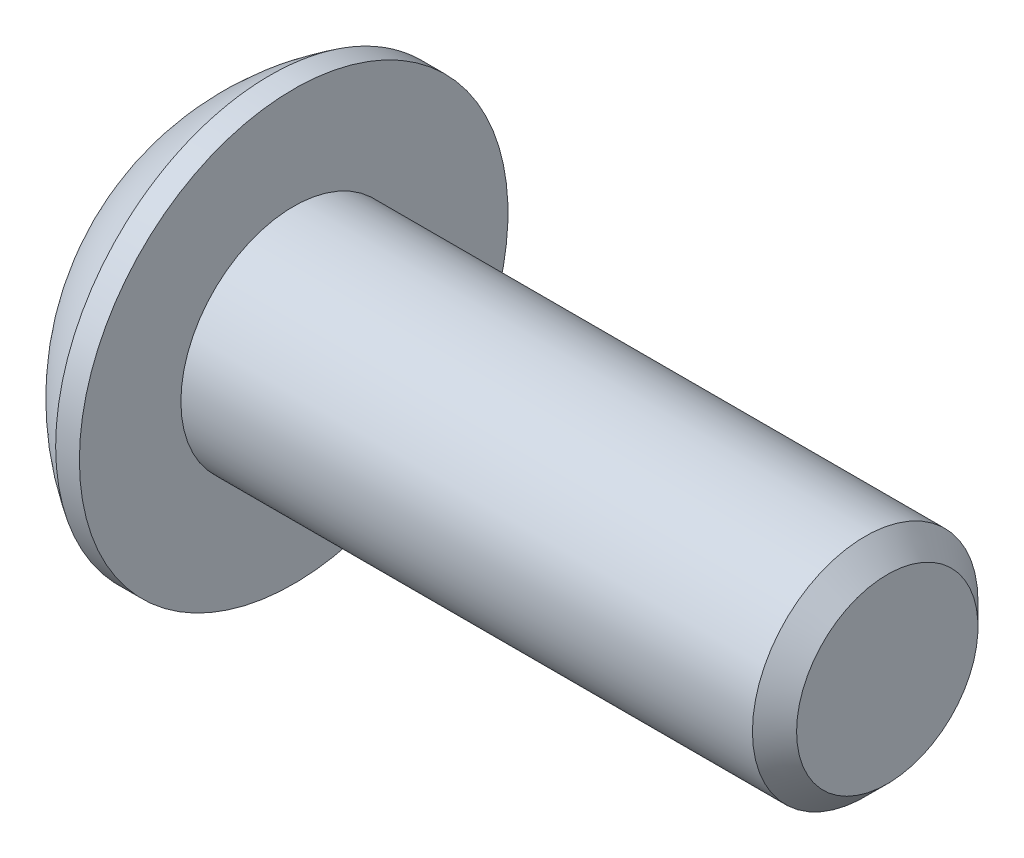
ISO-10303-21;
HEADER;
FILE_DESCRIPTION(('STEP AP214'),'2;1');
FILE_NAME('part.step','',(''),(''),'','','');
FILE_SCHEMA(('AUTOMOTIVE_DESIGN { 1 0 10303 214 1 1 1 1 }'));
ENDSEC;
DATA;
#1=APPLICATION_CONTEXT('core data for automotive mechanical design processes');
#2=APPLICATION_PROTOCOL_DEFINITION('international standard','automotive_design',2000,#1);
#3=PRODUCT_CONTEXT('',#1,'mechanical');
#4=PRODUCT('Part','Part','',(#3));
#5=PRODUCT_RELATED_PRODUCT_CATEGORY('part','',(#4));
#6=PRODUCT_DEFINITION_FORMATION('','',#4);
#7=PRODUCT_DEFINITION_CONTEXT('part definition',#1,'design');
#8=PRODUCT_DEFINITION('design','',#6,#7);
#9=PRODUCT_DEFINITION_SHAPE('','',#8);
#10=(LENGTH_UNIT() NAMED_UNIT(*) SI_UNIT(.MILLI.,.METRE.));
#11=(NAMED_UNIT(*) PLANE_ANGLE_UNIT() SI_UNIT($,.RADIAN.));
#12=(NAMED_UNIT(*) SI_UNIT($,.STERADIAN.) SOLID_ANGLE_UNIT());
#13=UNCERTAINTY_MEASURE_WITH_UNIT(LENGTH_MEASURE(1.E-05),#10,'distance_accuracy_value','');
#14=(GEOMETRIC_REPRESENTATION_CONTEXT(3) GLOBAL_UNCERTAINTY_ASSIGNED_CONTEXT((#13)) GLOBAL_UNIT_ASSIGNED_CONTEXT((#10,
#11,#12)) REPRESENTATION_CONTEXT('',''));
#15=CARTESIAN_POINT('',(0.,0.,0.));
#16=DIRECTION('',(0.,0.,1.));
#17=DIRECTION('',(1.,0.,0.));
#18=AXIS2_PLACEMENT_3D('',#15,#16,#17);
#19=CARTESIAN_POINT('',(1.77800000000017,0.,0.));
#20=DIRECTION('',(-1.,0.,0.));
#21=DIRECTION('',(0.,0.,1.));
#22=AXIS2_PLACEMENT_3D('',#19,#20,#21);
#23=CONICAL_SURFACE('',#22,1.58749999999985,1.04719755119662);
#24=CARTESIAN_POINT('',(2.69454355233856,0.,0.));
#25=VERTEX_POINT('',#24);
#26=VERTEX_LOOP('',#25);
#27=FACE_BOUND('',#26,.T.);
#28=CARTESIAN_POINT('',(1.77800000000017,0.,0.));
#29=DIRECTION('',(-1.,0.,0.));
#30=DIRECTION('',(0.,0.,1.));
#31=AXIS2_PLACEMENT_3D('',#28,#29,#30);
#32=CIRCLE('',#31,1.58749999999985);
#33=CARTESIAN_POINT('',(1.77800000000008,0.,1.58749999999993));
#34=VERTEX_POINT('',#33);
#35=CARTESIAN_POINT('',(1.77800000000008,-1.37481532850773,0.793749999999963));
#36=VERTEX_POINT('',#35);
#37=EDGE_CURVE('E20',#34,#36,#32,.F.);
#38=ORIENTED_EDGE('',*,*,#37,.F.);
#39=CARTESIAN_POINT('',(1.77800000000017,0.,0.));
#40=DIRECTION('',(-1.,0.,0.));
#41=DIRECTION('',(0.,0.,1.));
#42=AXIS2_PLACEMENT_3D('',#39,#40,#41);
#43=CIRCLE('',#42,1.58749999999985);
#44=CARTESIAN_POINT('',(1.77800000000008,1.37481532850773,0.793749999999963));
#45=VERTEX_POINT('',#44);
#46=EDGE_CURVE('E90',#34,#45,#43,.T.);
#47=ORIENTED_EDGE('',*,*,#46,.T.);
#48=CARTESIAN_POINT('',(1.77800000000017,0.,0.));
#49=DIRECTION('',(-1.,0.,0.));
#50=DIRECTION('',(0.,0.,1.));
#51=AXIS2_PLACEMENT_3D('',#48,#49,#50);
#52=CIRCLE('',#51,1.58749999999985);
#53=CARTESIAN_POINT('',(1.77800000000008,1.37481532850773,-0.793749999999964));
#54=VERTEX_POINT('',#53);
#55=EDGE_CURVE('E106',#45,#54,#52,.T.);
#56=ORIENTED_EDGE('',*,*,#55,.T.);
#57=CARTESIAN_POINT('',(1.77800000000017,0.,0.));
#58=DIRECTION('',(-1.,0.,0.));
#59=DIRECTION('',(0.,0.,1.));
#60=AXIS2_PLACEMENT_3D('',#57,#58,#59);
#61=CIRCLE('',#60,1.58749999999985);
#62=CARTESIAN_POINT('',(1.77800000000008,2.13833679173112E-12,-1.58749999999993));
#63=VERTEX_POINT('',#62);
#64=EDGE_CURVE('E444',#54,#63,#61,.T.);
#65=ORIENTED_EDGE('',*,*,#64,.T.);
#66=CARTESIAN_POINT('',(1.77800000000017,0.,0.));
#67=DIRECTION('',(-1.,0.,0.));
#68=DIRECTION('',(0.,0.,1.));
#69=AXIS2_PLACEMENT_3D('',#66,#67,#68);
#70=CIRCLE('',#69,1.58749999999985);
#71=CARTESIAN_POINT('',(1.77800000000008,-1.37481532850773,-0.793749999999963));
#72=VERTEX_POINT('',#71);
#73=EDGE_CURVE('E446',#72,#63,#70,.F.);
#74=ORIENTED_EDGE('',*,*,#73,.F.);
#75=CARTESIAN_POINT('',(1.77800000000017,0.,0.));
#76=DIRECTION('',(-1.,0.,0.));
#77=DIRECTION('',(0.,0.,1.));
#78=AXIS2_PLACEMENT_3D('',#75,#76,#77);
#79=CIRCLE('',#78,1.58749999999985);
#80=EDGE_CURVE('E93',#36,#72,#79,.F.);
#81=ORIENTED_EDGE('',*,*,#80,.F.);
#82=EDGE_LOOP('',(#38,#47,#56,#65,#74,#81));
#83=FACE_BOUND('',#82,.T.);
#84=ADVANCED_FACE('F17',(#27,#83),#23,.F.);
#85=CARTESIAN_POINT('',(1.778,-2.74963065701559,-1.5875));
#86=DIRECTION('',(1.,0.,0.));
#87=DIRECTION('',(0.,0.,-1.));
#88=AXIS2_PLACEMENT_3D('',#85,#86,#87);
#89=PLANE('',#88);
#90=DIRECTION('',(0.,0.5,0.866025403784439));
#91=VECTOR('',#90,1.);
#92=CARTESIAN_POINT('',(1.778,-1.83308710467706,0.));
#93=LINE('',#92,#91);
#94=CARTESIAN_POINT('',(1.778,-0.916543552338531,1.5875));
#95=VERTEX_POINT('',#94);
#96=EDGE_CURVE('E111',#95,#36,#93,.F.);
#97=ORIENTED_EDGE('',*,*,#96,.F.);
#98=DIRECTION('',(0.,1.,0.));
#99=VECTOR('',#98,1.);
#100=CARTESIAN_POINT('',(1.778,-0.916543552338531,1.5875));
#101=LINE('',#100,#99);
#102=EDGE_CURVE('E109',#34,#95,#101,.F.);
#103=ORIENTED_EDGE('',*,*,#102,.F.);
#104=ORIENTED_EDGE('',*,*,#37,.T.);
#105=EDGE_LOOP('',(#97,#103,#104));
#106=FACE_BOUND('',#105,.T.);
#107=ADVANCED_FACE('F110',(#106),#89,.F.);
#108=CARTESIAN_POINT('',(1.778,-2.74963065701559,-1.5875));
#109=DIRECTION('',(1.,0.,0.));
#110=DIRECTION('',(0.,0.,-1.));
#111=AXIS2_PLACEMENT_3D('',#108,#109,#110);
#112=PLANE('',#111);
#113=DIRECTION('',(0.,-0.5,0.866025403784439));
#114=VECTOR('',#113,1.);
#115=CARTESIAN_POINT('',(1.778,-0.916543552338531,-1.5875));
#116=LINE('',#115,#114);
#117=CARTESIAN_POINT('',(1.778,-1.83308710467706,0.));
#118=VERTEX_POINT('',#117);
#119=EDGE_CURVE('E159',#118,#72,#116,.F.);
#120=ORIENTED_EDGE('',*,*,#119,.F.);
#121=DIRECTION('',(0.,0.5,0.866025403784439));
#122=VECTOR('',#121,1.);
#123=CARTESIAN_POINT('',(1.778,-1.83308710467706,0.));
#124=LINE('',#123,#122);
#125=EDGE_CURVE('E171',#36,#118,#124,.F.);
#126=ORIENTED_EDGE('',*,*,#125,.F.);
#127=ORIENTED_EDGE('',*,*,#80,.T.);
#128=EDGE_LOOP('',(#120,#126,#127));
#129=FACE_BOUND('',#128,.T.);
#130=ADVANCED_FACE('F248',(#129),#112,.F.);
#131=CARTESIAN_POINT('',(1.778,-2.74963065701559,-1.5875));
#132=DIRECTION('',(1.,0.,0.));
#133=DIRECTION('',(0.,0.,-1.));
#134=AXIS2_PLACEMENT_3D('',#131,#132,#133);
#135=PLANE('',#134);
#136=DIRECTION('',(0.,1.,0.));
#137=VECTOR('',#136,1.);
#138=CARTESIAN_POINT('',(1.778,0.916543552338531,-1.5875));
#139=LINE('',#138,#137);
#140=CARTESIAN_POINT('',(1.778,-0.916543552338531,-1.5875));
#141=VERTEX_POINT('',#140);
#142=EDGE_CURVE('E143',#141,#63,#139,.T.);
#143=ORIENTED_EDGE('',*,*,#142,.F.);
#144=DIRECTION('',(0.,-0.5,0.866025403784439));
#145=VECTOR('',#144,1.);
#146=CARTESIAN_POINT('',(1.778,-0.916543552338531,-1.5875));
#147=LINE('',#146,#145);
#148=EDGE_CURVE('E156',#72,#141,#147,.F.);
#149=ORIENTED_EDGE('',*,*,#148,.F.);
#150=ORIENTED_EDGE('',*,*,#73,.T.);
#151=EDGE_LOOP('',(#143,#149,#150));
#152=FACE_BOUND('',#151,.T.);
#153=ADVANCED_FACE('F244',(#152),#135,.F.);
#154=CARTESIAN_POINT('',(1.778,-2.74963065701559,-1.5875));
#155=DIRECTION('',(1.,0.,0.));
#156=DIRECTION('',(0.,0.,-1.));
#157=AXIS2_PLACEMENT_3D('',#154,#155,#156);
#158=PLANE('',#157);
#159=DIRECTION('',(0.,-0.5,-0.866025403784439));
#160=VECTOR('',#159,1.);
#161=CARTESIAN_POINT('',(1.778,1.83308710467706,0.));
#162=LINE('',#161,#160);
#163=CARTESIAN_POINT('',(1.778,0.916543552338531,-1.5875));
#164=VERTEX_POINT('',#163);
#165=EDGE_CURVE('E128',#164,#54,#162,.F.);
#166=ORIENTED_EDGE('',*,*,#165,.F.);
#167=DIRECTION('',(0.,1.,0.));
#168=VECTOR('',#167,1.);
#169=CARTESIAN_POINT('',(1.778,0.916543552338531,-1.5875));
#170=LINE('',#169,#168);
#171=EDGE_CURVE('E140',#63,#164,#170,.T.);
#172=ORIENTED_EDGE('',*,*,#171,.F.);
#173=ORIENTED_EDGE('',*,*,#64,.F.);
#174=EDGE_LOOP('',(#166,#172,#173));
#175=FACE_BOUND('',#174,.T.);
#176=ADVANCED_FACE('F240',(#175),#158,.F.);
#177=CARTESIAN_POINT('',(1.778,-2.74963065701559,-1.5875));
#178=DIRECTION('',(1.,0.,0.));
#179=DIRECTION('',(0.,0.,-1.));
#180=AXIS2_PLACEMENT_3D('',#177,#178,#179);
#181=PLANE('',#180);
#182=DIRECTION('',(0.,0.5,-0.866025403784439));
#183=VECTOR('',#182,1.);
#184=CARTESIAN_POINT('',(1.778,0.916543552338531,1.5875));
#185=LINE('',#184,#183);
#186=CARTESIAN_POINT('',(1.778,1.83308710467706,0.));
#187=VERTEX_POINT('',#186);
#188=EDGE_CURVE('E148',#187,#45,#185,.F.);
#189=ORIENTED_EDGE('',*,*,#188,.F.);
#190=DIRECTION('',(0.,-0.5,-0.866025403784439));
#191=VECTOR('',#190,1.);
#192=CARTESIAN_POINT('',(1.778,1.83308710467706,0.));
#193=LINE('',#192,#191);
#194=EDGE_CURVE('E125',#54,#187,#193,.F.);
#195=ORIENTED_EDGE('',*,*,#194,.F.);
#196=ORIENTED_EDGE('',*,*,#55,.F.);
#197=EDGE_LOOP('',(#189,#195,#196));
#198=FACE_BOUND('',#197,.T.);
#199=ADVANCED_FACE('F237',(#198),#181,.F.);
#200=CARTESIAN_POINT('',(1.778,-2.74963065701559,-1.5875));
#201=DIRECTION('',(1.,0.,0.));
#202=DIRECTION('',(0.,0.,-1.));
#203=AXIS2_PLACEMENT_3D('',#200,#201,#202);
#204=PLANE('',#203);
#205=DIRECTION('',(0.,1.,0.));
#206=VECTOR('',#205,1.);
#207=CARTESIAN_POINT('',(1.778,-0.916543552338531,1.5875));
#208=LINE('',#207,#206);
#209=CARTESIAN_POINT('',(1.778,0.91654355233853,1.5875));
#210=VERTEX_POINT('',#209);
#211=EDGE_CURVE('E101',#210,#34,#208,.F.);
#212=ORIENTED_EDGE('',*,*,#211,.F.);
#213=DIRECTION('',(0.,0.5,-0.866025403784439));
#214=VECTOR('',#213,1.);
#215=CARTESIAN_POINT('',(1.778,0.916543552338531,1.5875));
#216=LINE('',#215,#214);
#217=EDGE_CURVE('E104',#45,#210,#216,.F.);
#218=ORIENTED_EDGE('',*,*,#217,.F.);
#219=ORIENTED_EDGE('',*,*,#46,.F.);
#220=EDGE_LOOP('',(#212,#218,#219));
#221=FACE_BOUND('',#220,.T.);
#222=ADVANCED_FACE('F99',(#221),#204,.F.);
#223=CARTESIAN_POINT('',(1.778,-0.916543552338531,1.5875));
#224=DIRECTION('',(0.,0.,-1.));
#225=DIRECTION('',(0.,1.,0.));
#226=AXIS2_PLACEMENT_3D('',#223,#224,#225);
#227=PLANE('',#226);
#228=DIRECTION('',(0.,1.,0.));
#229=VECTOR('',#228,1.);
#230=CARTESIAN_POINT('',(0.,0.,1.5875));
#231=LINE('',#230,#229);
#232=CARTESIAN_POINT('',(0.,0.916543552338531,1.5875));
#233=VERTEX_POINT('',#232);
#234=CARTESIAN_POINT('',(0.,-0.916543552338531,1.5875));
#235=VERTEX_POINT('',#234);
#236=EDGE_CURVE('E132',#233,#235,#231,.F.);
#237=ORIENTED_EDGE('',*,*,#236,.F.);
#238=DIRECTION('',(1.,0.,0.));
#239=VECTOR('',#238,1.);
#240=CARTESIAN_POINT('',(1.778,0.916543552338531,1.5875));
#241=LINE('',#240,#239);
#242=EDGE_CURVE('E117',#210,#233,#241,.F.);
#243=ORIENTED_EDGE('',*,*,#242,.F.);
#244=ORIENTED_EDGE('',*,*,#211,.T.);
#245=ORIENTED_EDGE('',*,*,#102,.T.);
#246=DIRECTION('',(1.,0.,0.));
#247=VECTOR('',#246,1.);
#248=CARTESIAN_POINT('',(1.778,-0.916543552338531,1.5875));
#249=LINE('',#248,#247);
#250=EDGE_CURVE('E168',#235,#95,#249,.T.);
#251=ORIENTED_EDGE('',*,*,#250,.F.);
#252=EDGE_LOOP('',(#237,#243,#244,#245,#251));
#253=FACE_BOUND('',#252,.T.);
#254=ADVANCED_FACE('F115',(#253),#227,.T.);
#255=CARTESIAN_POINT('',(1.778,-1.83308710467706,0.));
#256=DIRECTION('',(0.,0.866025403784439,-0.5));
#257=DIRECTION('',(0.,0.5,0.866025403784439));
#258=AXIS2_PLACEMENT_3D('',#255,#256,#257);
#259=PLANE('',#258);
#260=DIRECTION('',(0.,-0.5,-0.866025403784439));
#261=VECTOR('',#260,1.);
#262=CARTESIAN_POINT('',(0.,-0.916543552338531,1.5875));
#263=LINE('',#262,#261);
#264=CARTESIAN_POINT('',(0.,-1.83308710467706,0.));
#265=VERTEX_POINT('',#264);
#266=EDGE_CURVE('E430',#235,#265,#263,.T.);
#267=ORIENTED_EDGE('',*,*,#266,.F.);
#268=ORIENTED_EDGE('',*,*,#250,.T.);
#269=ORIENTED_EDGE('',*,*,#96,.T.);
#270=ORIENTED_EDGE('',*,*,#125,.T.);
#271=DIRECTION('',(1.,0.,0.));
#272=VECTOR('',#271,1.);
#273=CARTESIAN_POINT('',(1.778,-1.83308710467706,0.));
#274=LINE('',#273,#272);
#275=EDGE_CURVE('E153',#265,#118,#274,.T.);
#276=ORIENTED_EDGE('',*,*,#275,.F.);
#277=EDGE_LOOP('',(#267,#268,#269,#270,#276));
#278=FACE_BOUND('',#277,.T.);
#279=ADVANCED_FACE('F228',(#278),#259,.T.);
#280=CARTESIAN_POINT('',(1.778,-0.916543552338531,-1.5875));
#281=DIRECTION('',(0.,0.866025403784439,0.5));
#282=DIRECTION('',(0.,-0.5,0.866025403784439));
#283=AXIS2_PLACEMENT_3D('',#280,#281,#282);
#284=PLANE('',#283);
#285=DIRECTION('',(0.,0.5,-0.866025403784439));
#286=VECTOR('',#285,1.);
#287=CARTESIAN_POINT('',(0.,-1.83308710467706,0.));
#288=LINE('',#287,#286);
#289=CARTESIAN_POINT('',(0.,-0.916543552338531,-1.5875));
#290=VERTEX_POINT('',#289);
#291=EDGE_CURVE('E427',#265,#290,#288,.T.);
#292=ORIENTED_EDGE('',*,*,#291,.F.);
#293=ORIENTED_EDGE('',*,*,#275,.T.);
#294=ORIENTED_EDGE('',*,*,#119,.T.);
#295=ORIENTED_EDGE('',*,*,#148,.T.);
#296=DIRECTION('',(1.,0.,0.));
#297=VECTOR('',#296,1.);
#298=CARTESIAN_POINT('',(1.778,-0.916543552338531,-1.5875));
#299=LINE('',#298,#297);
#300=EDGE_CURVE('E137',#290,#141,#299,.T.);
#301=ORIENTED_EDGE('',*,*,#300,.F.);
#302=EDGE_LOOP('',(#292,#293,#294,#295,#301));
#303=FACE_BOUND('',#302,.T.);
#304=ADVANCED_FACE('F224',(#303),#284,.T.);
#305=CARTESIAN_POINT('',(1.778,0.916543552338531,-1.5875));
#306=DIRECTION('',(0.,0.,1.));
#307=DIRECTION('',(1.,0.,0.));
#308=AXIS2_PLACEMENT_3D('',#305,#306,#307);
#309=PLANE('',#308);
#310=DIRECTION('',(0.,1.,0.));
#311=VECTOR('',#310,1.);
#312=CARTESIAN_POINT('',(0.,0.,-1.5875));
#313=LINE('',#312,#311);
#314=CARTESIAN_POINT('',(0.,0.916543552338531,-1.5875));
#315=VERTEX_POINT('',#314);
#316=EDGE_CURVE('E424',#290,#315,#313,.T.);
#317=ORIENTED_EDGE('',*,*,#316,.F.);
#318=ORIENTED_EDGE('',*,*,#300,.T.);
#319=ORIENTED_EDGE('',*,*,#142,.T.);
#320=ORIENTED_EDGE('',*,*,#171,.T.);
#321=DIRECTION('',(1.,0.,0.));
#322=VECTOR('',#321,1.);
#323=CARTESIAN_POINT('',(1.778,0.916543552338531,-1.5875));
#324=LINE('',#323,#322);
#325=EDGE_CURVE('E127',#315,#164,#324,.T.);
#326=ORIENTED_EDGE('',*,*,#325,.F.);
#327=EDGE_LOOP('',(#317,#318,#319,#320,#326));
#328=FACE_BOUND('',#327,.T.);
#329=ADVANCED_FACE('F221',(#328),#309,.T.);
#330=CARTESIAN_POINT('',(1.778,1.83308710467706,0.));
#331=DIRECTION('',(0.,-0.866025403784439,0.5));
#332=DIRECTION('',(0.,-0.5,-0.866025403784439));
#333=AXIS2_PLACEMENT_3D('',#330,#331,#332);
#334=PLANE('',#333);
#335=DIRECTION('',(0.,0.5,0.866025403784438));
#336=VECTOR('',#335,1.);
#337=CARTESIAN_POINT('',(0.,0.916543552338531,-1.5875));
#338=LINE('',#337,#336);
#339=CARTESIAN_POINT('',(0.,1.83308710467706,0.));
#340=VERTEX_POINT('',#339);
#341=EDGE_CURVE('E421',#315,#340,#338,.T.);
#342=ORIENTED_EDGE('',*,*,#341,.F.);
#343=ORIENTED_EDGE('',*,*,#325,.T.);
#344=ORIENTED_EDGE('',*,*,#165,.T.);
#345=ORIENTED_EDGE('',*,*,#194,.T.);
#346=DIRECTION('',(1.,0.,0.));
#347=VECTOR('',#346,1.);
#348=CARTESIAN_POINT('',(1.778,1.83308710467706,0.));
#349=LINE('',#348,#347);
#350=EDGE_CURVE('E35',#340,#187,#349,.T.);
#351=ORIENTED_EDGE('',*,*,#350,.F.);
#352=EDGE_LOOP('',(#342,#343,#344,#345,#351));
#353=FACE_BOUND('',#352,.T.);
#354=ADVANCED_FACE('F217',(#353),#334,.T.);
#355=CARTESIAN_POINT('',(1.778,0.916543552338531,1.5875));
#356=DIRECTION('',(0.,-0.866025403784439,-0.5));
#357=DIRECTION('',(0.,0.5,-0.866025403784439));
#358=AXIS2_PLACEMENT_3D('',#355,#356,#357);
#359=PLANE('',#358);
#360=DIRECTION('',(0.,-0.5,0.866025403784439));
#361=VECTOR('',#360,1.);
#362=CARTESIAN_POINT('',(0.,1.83308710467706,0.));
#363=LINE('',#362,#361);
#364=EDGE_CURVE('E203',#340,#233,#363,.T.);
#365=ORIENTED_EDGE('',*,*,#364,.F.);
#366=ORIENTED_EDGE('',*,*,#350,.T.);
#367=ORIENTED_EDGE('',*,*,#188,.T.);
#368=ORIENTED_EDGE('',*,*,#217,.T.);
#369=ORIENTED_EDGE('',*,*,#242,.T.);
#370=EDGE_LOOP('',(#365,#366,#367,#368,#369));
#371=FACE_BOUND('',#370,.T.);
#372=ADVANCED_FACE('F213',(#371),#359,.T.);
#373=CARTESIAN_POINT('',(0.,0.,0.));
#374=DIRECTION('',(-1.,0.,0.));
#375=DIRECTION('',(0.,0.,1.));
#376=AXIS2_PLACEMENT_3D('',#373,#374,#375);
#377=PLANE('',#376);
#378=ORIENTED_EDGE('',*,*,#341,.T.);
#379=ORIENTED_EDGE('',*,*,#364,.T.);
#380=ORIENTED_EDGE('',*,*,#236,.T.);
#381=ORIENTED_EDGE('',*,*,#266,.T.);
#382=ORIENTED_EDGE('',*,*,#291,.T.);
#383=ORIENTED_EDGE('',*,*,#316,.T.);
#384=EDGE_LOOP('',(#378,#379,#380,#381,#382,#383));
#385=FACE_BOUND('',#384,.T.);
#386=CARTESIAN_POINT('',(0.,2.29235,0.));
#387=CARTESIAN_POINT('',(0.,2.29234961429956,0.0643619991867154));
#388=CARTESIAN_POINT('',(0.,2.28963695190107,0.128735826629365));
#389=CARTESIAN_POINT('',(0.,2.27880393843647,0.257038618985285));
#390=CARTESIAN_POINT('',(0.,2.27068199085126,0.320967446929161));
#391=CARTESIAN_POINT('',(0.,2.24906694794255,0.448021254607716));
#392=CARTESIAN_POINT('',(-2.10824444716781E-13,2.2355653265346,0.511144793381859));
#393=CARTESIAN_POINT('',(2.11863601159802E-13,2.20328400495643,0.636065176149319));
#394=CARTESIAN_POINT('',(7.89859250285223E-13,2.18450002159113,0.697860899533932));
#395=CARTESIAN_POINT('',(1.31296773573208E-12,2.12048422735802,0.880329802927746));
#396=CARTESIAN_POINT('',(0.,2.06753599079458,0.998391795928114));
#397=CARTESIAN_POINT('',(0.,1.94254204858672,1.22393765942147));
#398=CARTESIAN_POINT('',(1.09192433983777E-12,1.87049561696642,1.33142112758208));
#399=CARTESIAN_POINT('',(6.76836653156935E-13,1.7497425419488,1.48237719670934));
#400=CARTESIAN_POINT('',(1.81575153564244E-13,1.707345731323,1.53101280076737));
#401=CARTESIAN_POINT('',(-1.80533144163887E-13,1.61863910291528,1.62450601319184));
#402=CARTESIAN_POINT('',(0.,1.57233309727312,1.66936721890417));
#403=CARTESIAN_POINT('',(0.,1.47608431707233,1.75504884204019));
#404=CARTESIAN_POINT('',(0.,1.42613990458994,1.79586741981511));
#405=CARTESIAN_POINT('',(0.,1.3229945254125,1.87315615311522));
#406=CARTESIAN_POINT('',(0.,1.26979280714187,1.90962529930696));
#407=CARTESIAN_POINT('',(0.,1.10588180153952,2.01207722151089));
#408=CARTESIAN_POINT('',(0.,0.990764947001307,2.07119486286665));
#409=CARTESIAN_POINT('',(0.,0.752302198839713,2.16922858468855));
#410=CARTESIAN_POINT('',(0.,0.628956393121259,2.20814488091449));
#411=CARTESIAN_POINT('',(0.,0.377466101733269,2.2647275576592));
#412=CARTESIAN_POINT('',(0.,0.249321590440379,2.28239382469378));
#413=CARTESIAN_POINT('',(0.,-0.00811435371610861,2.29595665980954));
#414=CARTESIAN_POINT('',(0.,-0.137405786579706,2.29185322789071));
#415=CARTESIAN_POINT('',(0.,-0.393449386933726,2.26200962409059));
#416=CARTESIAN_POINT('',(0.,-0.520201567981084,2.23626956775765));
#417=CARTESIAN_POINT('',(0.,-0.767645294384451,2.16383549332686));
#418=CARTESIAN_POINT('',(0.,-0.888336774993556,2.11714125142685));
#419=CARTESIAN_POINT('',(0.,-1.06210572146656,2.03247976453653));
#420=CARTESIAN_POINT('',(0.,-1.11884498714066,2.00180278323694));
#421=CARTESIAN_POINT('',(0.,-1.22954062855573,1.93578011658035));
#422=CARTESIAN_POINT('',(0.,-1.28349764565393,1.9004355139425));
#423=CARTESIAN_POINT('',(0.,-1.38821676641537,1.82534174602347));
#424=CARTESIAN_POINT('',(0.,-1.43898030563028,1.78559458231503));
#425=CARTESIAN_POINT('',(0.,-1.53701984534431,1.70193996292361));
#426=CARTESIAN_POINT('',(0.,-1.58429243280551,1.65802852924127));
#427=CARTESIAN_POINT('',(0.,-1.72023903553759,1.52059650554139));
#428=CARTESIAN_POINT('',(0.,-1.80318066138238,1.42127847626519));
#429=CARTESIAN_POINT('',(0.,-1.95118232345098,1.21011519784663));
#430=CARTESIAN_POINT('',(0.,-2.01624303935584,1.09827042509272));
#431=CARTESIAN_POINT('',(0.,-2.09907772661315,0.923538238005834));
#432=CARTESIAN_POINT('',(0.,-2.12425103063558,0.864058373981961));
#433=CARTESIAN_POINT('',(0.,-2.16947990046565,0.743221562175596));
#434=CARTESIAN_POINT('',(0.,-2.18953960800684,0.681866178863361));
#435=CARTESIAN_POINT('',(0.,-2.22438542051156,0.557786972400353));
#436=CARTESIAN_POINT('',(0.,-2.23917985294818,0.49506547812817));
#437=CARTESIAN_POINT('',(0.,-2.26343456384453,0.368611258323513));
#438=CARTESIAN_POINT('',(0.,-2.27289641559286,0.304878836759568));
#439=CARTESIAN_POINT('',(0.,-2.28388649696737,0.200873029360624));
#440=CARTESIAN_POINT('',(0.,-2.28705930623294,0.160766164180097));
#441=CARTESIAN_POINT('',(0.,-2.29129117827044,0.0804410725432709));
#442=CARTESIAN_POINT('',(0.,-2.29235024104238,0.0402228460869715));
#443=CARTESIAN_POINT('',(0.,-2.29234961429956,-0.0643619991867169));
#444=CARTESIAN_POINT('',(0.,-2.28963695190108,-0.128735826629366));
#445=CARTESIAN_POINT('',(0.,-2.27880393843648,-0.257038618985287));
#446=CARTESIAN_POINT('',(0.,-2.27068199085126,-0.320967446929162));
#447=CARTESIAN_POINT('',(0.,-2.24906694794255,-0.448021254607717));
#448=CARTESIAN_POINT('',(-2.10834941255074E-13,-2.2355653265346,-0.51114479338186));
#449=CARTESIAN_POINT('',(2.11874106233861E-13,-2.20328400495644,-0.63606517614932));
#450=CARTESIAN_POINT('',(7.89916649312017E-13,-2.18450002159114,-0.697860899533933));
#451=CARTESIAN_POINT('',(1.31285321129287E-12,-2.12048422735802,-0.880329802927746));
#452=CARTESIAN_POINT('',(0.,-2.06753599079459,-0.998391795928113));
#453=CARTESIAN_POINT('',(0.,-1.94254204858672,-1.22393765942147));
#454=CARTESIAN_POINT('',(1.09438689187688E-12,-1.87049561696643,-1.33142112758208));
#455=CARTESIAN_POINT('',(6.78206985487681E-13,-1.7497425419488,-1.48237719670935));
#456=CARTESIAN_POINT('',(1.81942895083465E-13,-1.70734573132301,-1.53101280076737));
#457=CARTESIAN_POINT('',(-1.80900531124896E-13,-1.61863910291529,-1.62450601319185));
#458=CARTESIAN_POINT('',(0.,-1.57233309727312,-1.66936721890417));
#459=CARTESIAN_POINT('',(0.,-1.47608431707233,-1.7550488420402));
#460=CARTESIAN_POINT('',(0.,-1.42613990458994,-1.79586741981511));
#461=CARTESIAN_POINT('',(0.,-1.3229945254125,-1.87315615311522));
#462=CARTESIAN_POINT('',(0.,-1.26979280714187,-1.90962529930696));
#463=CARTESIAN_POINT('',(0.,-1.10588180153952,-2.01207722151089));
#464=CARTESIAN_POINT('',(0.,-0.990764947001311,-2.07119486286666));
#465=CARTESIAN_POINT('',(0.,-0.752302198839716,-2.16922858468855));
#466=CARTESIAN_POINT('',(0.,-0.628956393121259,-2.20814488091449));
#467=CARTESIAN_POINT('',(0.,-0.37746610173327,-2.26472755765919));
#468=CARTESIAN_POINT('',(0.,-0.249321590440381,-2.28239382469378));
#469=CARTESIAN_POINT('',(0.,0.00811435371610484,-2.29595665980955));
#470=CARTESIAN_POINT('',(0.,0.137405786579702,-2.29185322789072));
#471=CARTESIAN_POINT('',(0.,0.393449386933721,-2.26200962409059));
#472=CARTESIAN_POINT('',(0.,0.520201567981078,-2.23626956775766));
#473=CARTESIAN_POINT('',(0.,0.767645294384446,-2.16383549332687));
#474=CARTESIAN_POINT('',(0.,0.888336774993551,-2.11714125142685));
#475=CARTESIAN_POINT('',(0.,1.06210572146656,-2.03247976453653));
#476=CARTESIAN_POINT('',(0.,1.11884498714066,-2.00180278323695));
#477=CARTESIAN_POINT('',(0.,1.22954062855572,-1.93578011658035));
#478=CARTESIAN_POINT('',(0.,1.28349764565392,-1.9004355139425));
#479=CARTESIAN_POINT('',(0.,1.38821676641537,-1.82534174602347));
#480=CARTESIAN_POINT('',(0.,1.43898030563028,-1.78559458231503));
#481=CARTESIAN_POINT('',(0.,1.53701984534431,-1.70193996292361));
#482=CARTESIAN_POINT('',(0.,1.5842924328055,-1.65802852924126));
#483=CARTESIAN_POINT('',(0.,1.72023903553758,-1.52059650554139));
#484=CARTESIAN_POINT('',(0.,1.80318066138238,-1.42127847626519));
#485=CARTESIAN_POINT('',(0.,1.95118232345098,-1.21011519784663));
#486=CARTESIAN_POINT('',(0.,2.01624303935584,-1.09827042509272));
#487=CARTESIAN_POINT('',(0.,2.09907772661314,-0.923538238005835));
#488=CARTESIAN_POINT('',(0.,2.12425103063558,-0.864058373981964));
#489=CARTESIAN_POINT('',(0.,2.16947990046565,-0.743221562175599));
#490=CARTESIAN_POINT('',(0.,2.18953960800684,-0.681866178863364));
#491=CARTESIAN_POINT('',(0.,2.22438542051155,-0.557786972400356));
#492=CARTESIAN_POINT('',(0.,2.23917985294818,-0.495065478128172));
#493=CARTESIAN_POINT('',(0.,2.26343456384453,-0.368611258323515));
#494=CARTESIAN_POINT('',(0.,2.27289641559285,-0.304878836759569));
#495=CARTESIAN_POINT('',(0.,2.28388649696736,-0.200873029360625));
#496=CARTESIAN_POINT('',(0.,2.28705930623293,-0.160766164180098));
#497=CARTESIAN_POINT('',(0.,2.29129117827044,-0.0804410725432721));
#498=CARTESIAN_POINT('',(0.,2.29235024104238,-0.0402228460869726));
#499=CARTESIAN_POINT('',(0.,2.29235,0.));
#500=B_SPLINE_CURVE_WITH_KNOTS('',3,(#386,#387,#388,#389,#390,#391,#392,#393,#394,#395,#396,
#397,#398,#399,#400,#401,#402,#403,#404,#405,#406,#407,#408,#409,#410,#411,#412,#413,#414,#415,
#416,#417,#418,#419,#420,#421,#422,#423,#424,#425,#426,#427,#428,#429,#430,#431,#432,#433,#434,
#435,#436,#437,#438,#439,#440,#441,#442,#443,#444,#445,#446,#447,#448,#449,#450,#451,#452,#453,
#454,#455,#456,#457,#458,#459,#460,#461,#462,#463,#464,#465,#466,#467,#468,#469,#470,#471,#472,
#473,#474,#475,#476,#477,#478,#479,#480,#481,#482,#483,#484,#485,#486,#487,#488,#489,#490,#491,
#492,#493,#494,#495,#496,#497,#498,#499),.UNSPECIFIED.,.T.,.F.,(4,2,2,2,2,2,2,2,2,2,2,2,2,2,2,2,
2,2,2,2,2,2,2,2,2,2,2,2,2,2,2,2,2,2,2,2,2,2,2,2,2,2,2,2,2,2,2,2,2,2,2,2,2,2,2,2,4),(0.,
0.193048968618033,0.386154939782393,0.579568183995956,0.773138711491036,1.15935703864577,
1.54559004914644,1.73895960916368,1.93214273180063,2.12541336477221,2.31872876140888,
2.70495649282618,3.09118009906582,3.47740576789431,3.86363143672284,4.24985504296253,
4.63608277437978,4.82939817101618,5.02266880398747,5.21585192662418,5.4092214866412,
5.79545449714215,6.18167282429723,6.3752433517926,6.5686565960064,6.76176256717087,
6.95481153578906,7.0754569329192,7.19610233004935,7.38915129866738,7.58225726983175,
7.77567051404531,7.96924104154039,8.35545936869512,8.74169237919579,8.93506193921303,
9.12824506184998,9.32151569482156,9.51483109145823,9.90105882287553,10.2872824291152,
10.6735080979437,11.0597337667722,11.4459573730119,11.8321851044291,12.0255005010655,
12.2187711340368,12.4119542566735,12.6053238166906,12.9915568271915,13.3777751543466,
13.571345681842,13.7647589260558,13.9578648972202,14.1509138658384,14.2715592629686,
14.3922046600987),.UNSPECIFIED.);
#501=CARTESIAN_POINT('',(0.,2.29235,0.));
#502=VERTEX_POINT('',#501);
#503=EDGE_CURVE('E197',#502,#502,#500,.T.);
#504=ORIENTED_EDGE('',*,*,#503,.F.);
#505=EDGE_LOOP('',(#504));
#506=FACE_BOUND('',#505,.T.);
#507=ADVANCED_FACE('F209',(#385,#506),#377,.T.);
#508=CARTESIAN_POINT('',(4.85989606481482,0.,0.));
#509=DIRECTION('',(0.,1.,0.));
#510=DIRECTION('',(1.,0.,0.));
#511=AXIS2_PLACEMENT_3D('',#508,#509,#510);
#512=SPHERICAL_SURFACE('',#511,5.37340285883187);
#513=CARTESIAN_POINT('',(2.0574,0.,0.));
#514=DIRECTION('',(-1.,0.,0.));
#515=DIRECTION('',(0.,0.,1.));
#516=AXIS2_PLACEMENT_3D('',#513,#514,#515);
#517=CIRCLE('',#516,4.5847);
#518=CARTESIAN_POINT('',(2.0574,0.,4.5847));
#519=VERTEX_POINT('',#518);
#520=EDGE_CURVE('E194',#519,#519,#517,.F.);
#521=ORIENTED_EDGE('',*,*,#520,.F.);
#522=EDGE_LOOP('',(#521));
#523=FACE_BOUND('',#522,.T.);
#524=ORIENTED_EDGE('',*,*,#503,.T.);
#525=EDGE_LOOP('',(#524));
#526=FACE_BOUND('',#525,.T.);
#527=ADVANCED_FACE('F205',(#523,#526),#512,.T.);
#528=CARTESIAN_POINT('',(15.2654,0.,0.));
#529=DIRECTION('',(-1.,0.,0.));
#530=DIRECTION('',(0.,0.,1.));
#531=AXIS2_PLACEMENT_3D('',#528,#529,#530);
#532=PLANE('',#531);
#533=CARTESIAN_POINT('',(15.2654000000325,0.,0.));
#534=DIRECTION('',(-1.,0.,0.));
#535=DIRECTION('',(0.,0.,1.));
#536=AXIS2_PLACEMENT_3D('',#533,#534,#535);
#537=CIRCLE('',#536,1.94055999998);
#538=CARTESIAN_POINT('',(15.2654000000325,0.,1.94055999998));
#539=VERTEX_POINT('',#538);
#540=EDGE_CURVE('E191',#539,#539,#537,.T.);
#541=ORIENTED_EDGE('',*,*,#540,.F.);
#542=EDGE_LOOP('',(#541));
#543=FACE_BOUND('',#542,.T.);
#544=ADVANCED_FACE('F276',(#543),#532,.F.);
#545=CARTESIAN_POINT('',(0.,0.,0.));
#546=DIRECTION('',(-1.,0.,0.));
#547=DIRECTION('',(0.,0.,1.));
#548=AXIS2_PLACEMENT_3D('',#545,#546,#547);
#549=CYLINDRICAL_SURFACE('',#548,4.5847);
#550=ORIENTED_EDGE('',*,*,#520,.T.);
#551=EDGE_LOOP('',(#550));
#552=FACE_BOUND('',#551,.T.);
#553=CARTESIAN_POINT('',(2.5654,0.,0.));
#554=DIRECTION('',(-1.,0.,0.));
#555=DIRECTION('',(0.,0.,1.));
#556=AXIS2_PLACEMENT_3D('',#553,#554,#555);
#557=CIRCLE('',#556,4.5847);
#558=CARTESIAN_POINT('',(2.5654,0.,4.5847));
#559=VERTEX_POINT('',#558);
#560=EDGE_CURVE('E188',#559,#559,#557,.T.);
#561=ORIENTED_EDGE('',*,*,#560,.T.);
#562=EDGE_LOOP('',(#561));
#563=FACE_BOUND('',#562,.T.);
#564=ADVANCED_FACE('F273',(#552,#563),#549,.T.);
#565=CARTESIAN_POINT('',(14.7929599999657,0.,0.));
#566=DIRECTION('',(-1.,0.,0.));
#567=DIRECTION('',(0.,0.,1.));
#568=AXIS2_PLACEMENT_3D('',#565,#566,#567);
#569=CONICAL_SURFACE('',#568,2.41300000004685,0.785398163397448);
#570=CARTESIAN_POINT('',(14.79296,0.,0.));
#571=DIRECTION('',(-1.,0.,0.));
#572=DIRECTION('',(0.,0.,1.));
#573=AXIS2_PLACEMENT_3D('',#570,#571,#572);
#574=CIRCLE('',#573,2.413);
#575=CARTESIAN_POINT('',(14.79296,0.,2.413));
#576=VERTEX_POINT('',#575);
#577=EDGE_CURVE('E26',#576,#576,#574,.T.);
#578=ORIENTED_EDGE('',*,*,#577,.F.);
#579=EDGE_LOOP('',(#578));
#580=FACE_BOUND('',#579,.T.);
#581=ORIENTED_EDGE('',*,*,#540,.T.);
#582=EDGE_LOOP('',(#581));
#583=FACE_BOUND('',#582,.T.);
#584=ADVANCED_FACE('F266',(#580,#583),#569,.T.);
#585=CARTESIAN_POINT('',(2.5654,2.413,0.));
#586=DIRECTION('',(-1.,0.,0.));
#587=DIRECTION('',(0.,0.,1.));
#588=AXIS2_PLACEMENT_3D('',#585,#586,#587);
#589=PLANE('',#588);
#590=CARTESIAN_POINT('',(2.5654,0.,0.));
#591=DIRECTION('',(-1.,0.,0.));
#592=DIRECTION('',(0.,0.,1.));
#593=AXIS2_PLACEMENT_3D('',#590,#591,#592);
#594=CIRCLE('',#593,2.413);
#595=CARTESIAN_POINT('',(2.5654,0.,2.413));
#596=VERTEX_POINT('',#595);
#597=EDGE_CURVE('E11',#596,#596,#594,.F.);
#598=ORIENTED_EDGE('',*,*,#597,.F.);
#599=EDGE_LOOP('',(#598));
#600=FACE_BOUND('',#599,.T.);
#601=ORIENTED_EDGE('',*,*,#560,.F.);
#602=EDGE_LOOP('',(#601));
#603=FACE_BOUND('',#602,.T.);
#604=ADVANCED_FACE('F260',(#600,#603),#589,.F.);
#605=CARTESIAN_POINT('',(0.,0.,0.));
#606=DIRECTION('',(-1.,0.,0.));
#607=DIRECTION('',(0.,0.,1.));
#608=AXIS2_PLACEMENT_3D('',#605,#606,#607);
#609=CYLINDRICAL_SURFACE('',#608,2.413);
#610=ORIENTED_EDGE('',*,*,#597,.T.);
#611=EDGE_LOOP('',(#610));
#612=FACE_BOUND('',#611,.T.);
#613=ORIENTED_EDGE('',*,*,#577,.T.);
#614=EDGE_LOOP('',(#613));
#615=FACE_BOUND('',#614,.T.);
#616=ADVANCED_FACE('F258',(#612,#615),#609,.T.);
#617=CLOSED_SHELL('',(#84,#107,#130,#153,#176,#199,#222,#254,#279,#304,#329,#354,#372,#507,#527,
#544,#564,#584,#604,#616));
#618=MANIFOLD_SOLID_BREP('B1',#617);
#619=ADVANCED_BREP_SHAPE_REPRESENTATION('',(#18,#618),#14);
#620=SHAPE_DEFINITION_REPRESENTATION(#9,#619);
ENDSEC;
END-ISO-10303-21;
